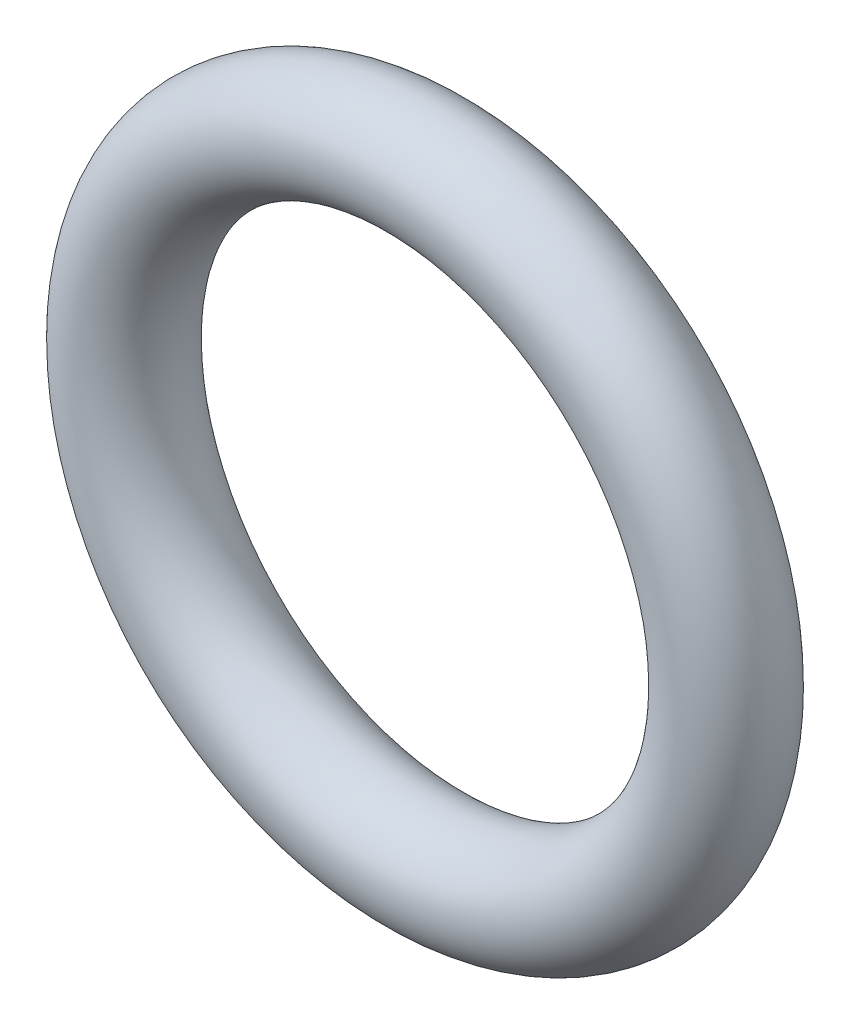
ISO-10303-21;
HEADER;
FILE_DESCRIPTION(('STEP AP214'),'2;1');
FILE_NAME('part.step','',(''),(''),'','','');
FILE_SCHEMA(('AUTOMOTIVE_DESIGN { 1 0 10303 214 1 1 1 1 }'));
ENDSEC;
DATA;
#1=APPLICATION_CONTEXT('core data for automotive mechanical design processes');
#2=APPLICATION_PROTOCOL_DEFINITION('international standard','automotive_design',2000,#1);
#3=PRODUCT_CONTEXT('',#1,'mechanical');
#4=PRODUCT('Part','Part','',(#3));
#5=PRODUCT_RELATED_PRODUCT_CATEGORY('part','',(#4));
#6=PRODUCT_DEFINITION_FORMATION('','',#4);
#7=PRODUCT_DEFINITION_CONTEXT('part definition',#1,'design');
#8=PRODUCT_DEFINITION('design','',#6,#7);
#9=PRODUCT_DEFINITION_SHAPE('','',#8);
#10=(LENGTH_UNIT() NAMED_UNIT(*) SI_UNIT(.MILLI.,.METRE.));
#11=(NAMED_UNIT(*) PLANE_ANGLE_UNIT() SI_UNIT($,.RADIAN.));
#12=(NAMED_UNIT(*) SI_UNIT($,.STERADIAN.) SOLID_ANGLE_UNIT());
#13=UNCERTAINTY_MEASURE_WITH_UNIT(LENGTH_MEASURE(1.E-05),#10,'distance_accuracy_value','');
#14=(GEOMETRIC_REPRESENTATION_CONTEXT(3) GLOBAL_UNCERTAINTY_ASSIGNED_CONTEXT((#13)) GLOBAL_UNIT_ASSIGNED_CONTEXT((#10,
#11,#12)) REPRESENTATION_CONTEXT('',''));
#15=CARTESIAN_POINT('',(0.,0.,0.));
#16=DIRECTION('',(0.,0.,1.));
#17=DIRECTION('',(1.,0.,0.));
#18=AXIS2_PLACEMENT_3D('',#15,#16,#17);
#19=CARTESIAN_POINT('',(0.,0.,0.));
#20=DIRECTION('',(0.,0.,-1.));
#21=DIRECTION('',(-1.,0.,0.));
#22=AXIS2_PLACEMENT_3D('',#19,#20,#21);
#23=TOROIDAL_SURFACE('',#22,6.6,1.2);
#24=CARTESIAN_POINT('',(-7.8,0.,0.));
#25=VERTEX_POINT('',#24);
#26=VERTEX_LOOP('',#25);
#27=FACE_BOUND('',#26,.T.);
#28=ADVANCED_FACE('F29',(#27),#23,.T.);
#29=CLOSED_SHELL('',(#28));
#30=MANIFOLD_SOLID_BREP('B2',#29);
#31=ADVANCED_BREP_SHAPE_REPRESENTATION('',(#18,#30),#14);
#32=SHAPE_DEFINITION_REPRESENTATION(#9,#31);
ENDSEC;
END-ISO-10303-21;
